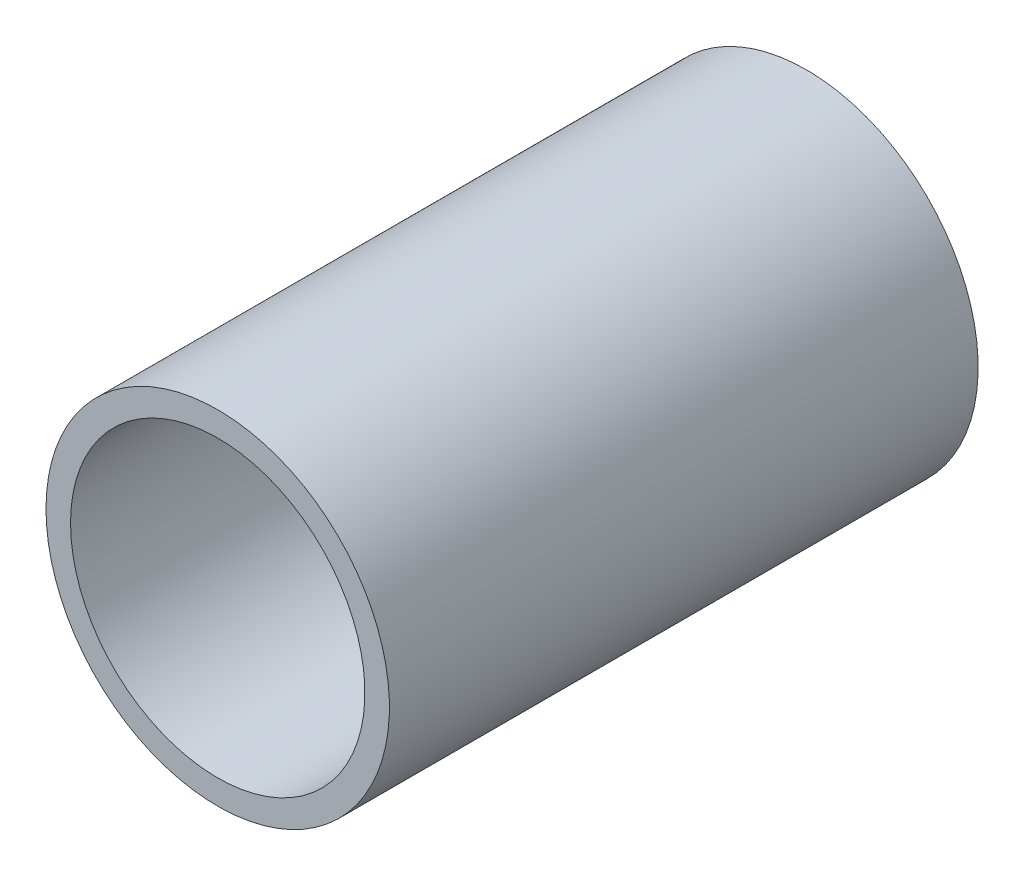
ISO-10303-21;
HEADER;
FILE_DESCRIPTION(('STEP AP214'),'2;1');
FILE_NAME('part.step','',(''),(''),'','','');
FILE_SCHEMA(('AUTOMOTIVE_DESIGN { 1 0 10303 214 1 1 1 1 }'));
ENDSEC;
DATA;
#1=APPLICATION_CONTEXT('core data for automotive mechanical design processes');
#2=APPLICATION_PROTOCOL_DEFINITION('international standard','automotive_design',2000,#1);
#3=PRODUCT_CONTEXT('',#1,'mechanical');
#4=PRODUCT('Part','Part','',(#3));
#5=PRODUCT_RELATED_PRODUCT_CATEGORY('part','',(#4));
#6=PRODUCT_DEFINITION_FORMATION('','',#4);
#7=PRODUCT_DEFINITION_CONTEXT('part definition',#1,'design');
#8=PRODUCT_DEFINITION('design','',#6,#7);
#9=PRODUCT_DEFINITION_SHAPE('','',#8);
#10=(LENGTH_UNIT() NAMED_UNIT(*) SI_UNIT(.MILLI.,.METRE.));
#11=(NAMED_UNIT(*) PLANE_ANGLE_UNIT() SI_UNIT($,.RADIAN.));
#12=(NAMED_UNIT(*) SI_UNIT($,.STERADIAN.) SOLID_ANGLE_UNIT());
#13=UNCERTAINTY_MEASURE_WITH_UNIT(LENGTH_MEASURE(1.E-05),#10,'distance_accuracy_value','');
#14=(GEOMETRIC_REPRESENTATION_CONTEXT(3) GLOBAL_UNCERTAINTY_ASSIGNED_CONTEXT((#13)) GLOBAL_UNIT_ASSIGNED_CONTEXT((#10,
#11,#12)) REPRESENTATION_CONTEXT('',''));
#15=CARTESIAN_POINT('',(0.,0.,0.));
#16=DIRECTION('',(0.,0.,1.));
#17=DIRECTION('',(1.,0.,0.));
#18=AXIS2_PLACEMENT_3D('',#15,#16,#17);
#19=CARTESIAN_POINT('',(0.,0.,0.25));
#20=DIRECTION('',(0.,0.,1.));
#21=DIRECTION('',(1.,0.,0.));
#22=AXIS2_PLACEMENT_3D('',#19,#20,#21);
#23=CYLINDRICAL_SURFACE('',#22,1.5);
#24=CARTESIAN_POINT('',(0.,0.,6.25));
#25=DIRECTION('',(0.,0.,-1.));
#26=DIRECTION('',(1.,0.,0.));
#27=AXIS2_PLACEMENT_3D('',#24,#25,#26);
#28=CIRCLE('',#27,1.5);
#29=CARTESIAN_POINT('',(-1.5,0.,6.25));
#30=VERTEX_POINT('',#29);
#31=EDGE_CURVE('E53',#30,#30,#28,.T.);
#32=ORIENTED_EDGE('',*,*,#31,.F.);
#33=DIRECTION('',(0.,0.,-1.));
#34=VECTOR('',#33,1.);
#35=CARTESIAN_POINT('',(-1.5,0.,0.25));
#36=LINE('',#35,#34);
#37=CARTESIAN_POINT('',(-1.5,0.,0.25));
#38=VERTEX_POINT('',#37);
#39=EDGE_CURVE('E11',#30,#38,#36,.T.);
#40=ORIENTED_EDGE('',*,*,#39,.T.);
#41=CARTESIAN_POINT('',(0.,0.,0.25));
#42=DIRECTION('',(0.,0.,-1.));
#43=DIRECTION('',(1.,0.,0.));
#44=AXIS2_PLACEMENT_3D('',#41,#42,#43);
#45=CIRCLE('',#44,1.5);
#46=EDGE_CURVE('E26',#38,#38,#45,.T.);
#47=ORIENTED_EDGE('',*,*,#46,.T.);
#48=ORIENTED_EDGE('',*,*,#39,.F.);
#49=EDGE_LOOP('',(#32,#40,#47,#48));
#50=FACE_BOUND('',#49,.T.);
#51=ADVANCED_FACE('F16',(#50),#23,.F.);
#52=CARTESIAN_POINT('',(0.,0.,0.25));
#53=DIRECTION('',(0.,0.,1.));
#54=DIRECTION('',(1.,0.,0.));
#55=AXIS2_PLACEMENT_3D('',#52,#53,#54);
#56=PLANE('',#55);
#57=ORIENTED_EDGE('',*,*,#46,.F.);
#58=EDGE_LOOP('',(#57));
#59=FACE_BOUND('',#58,.T.);
#60=CARTESIAN_POINT('',(0.,0.,0.25));
#61=DIRECTION('',(0.,0.,1.));
#62=DIRECTION('',(1.,0.,0.));
#63=AXIS2_PLACEMENT_3D('',#60,#61,#62);
#64=CIRCLE('',#63,1.75);
#65=CARTESIAN_POINT('',(-1.75,0.,0.25));
#66=VERTEX_POINT('',#65);
#67=EDGE_CURVE('E64',#66,#66,#64,.T.);
#68=ORIENTED_EDGE('',*,*,#67,.F.);
#69=EDGE_LOOP('',(#68));
#70=FACE_BOUND('',#69,.T.);
#71=ADVANCED_FACE('F76',(#59,#70),#56,.F.);
#72=CARTESIAN_POINT('',(0.,0.,0.25));
#73=DIRECTION('',(0.,0.,1.));
#74=DIRECTION('',(1.,0.,0.));
#75=AXIS2_PLACEMENT_3D('',#72,#73,#74);
#76=CYLINDRICAL_SURFACE('',#75,1.75);
#77=CARTESIAN_POINT('',(0.,0.,6.25));
#78=DIRECTION('',(0.,0.,1.));
#79=DIRECTION('',(1.,0.,0.));
#80=AXIS2_PLACEMENT_3D('',#77,#78,#79);
#81=CIRCLE('',#80,1.75);
#82=CARTESIAN_POINT('',(-1.75,0.,6.25));
#83=VERTEX_POINT('',#82);
#84=EDGE_CURVE('E58',#83,#83,#81,.T.);
#85=ORIENTED_EDGE('',*,*,#84,.F.);
#86=DIRECTION('',(0.,0.,-1.));
#87=VECTOR('',#86,1.);
#88=CARTESIAN_POINT('',(-1.75,0.,0.25));
#89=LINE('',#88,#87);
#90=EDGE_CURVE('E48',#83,#66,#89,.T.);
#91=ORIENTED_EDGE('',*,*,#90,.T.);
#92=ORIENTED_EDGE('',*,*,#67,.T.);
#93=ORIENTED_EDGE('',*,*,#90,.F.);
#94=EDGE_LOOP('',(#85,#91,#92,#93));
#95=FACE_BOUND('',#94,.T.);
#96=ADVANCED_FACE('F74',(#95),#76,.T.);
#97=CARTESIAN_POINT('',(0.,0.,6.25));
#98=DIRECTION('',(0.,0.,1.));
#99=DIRECTION('',(1.,0.,0.));
#100=AXIS2_PLACEMENT_3D('',#97,#98,#99);
#101=PLANE('',#100);
#102=ORIENTED_EDGE('',*,*,#31,.T.);
#103=EDGE_LOOP('',(#102));
#104=FACE_BOUND('',#103,.T.);
#105=ORIENTED_EDGE('',*,*,#84,.T.);
#106=EDGE_LOOP('',(#105));
#107=FACE_BOUND('',#106,.T.);
#108=ADVANCED_FACE('F18',(#104,#107),#101,.T.);
#109=CLOSED_SHELL('',(#51,#71,#96,#108));
#110=MANIFOLD_SOLID_BREP('B1',#109);
#111=ADVANCED_BREP_SHAPE_REPRESENTATION('',(#18,#110),#14);
#112=SHAPE_DEFINITION_REPRESENTATION(#9,#111);
ENDSEC;
END-ISO-10303-21;
